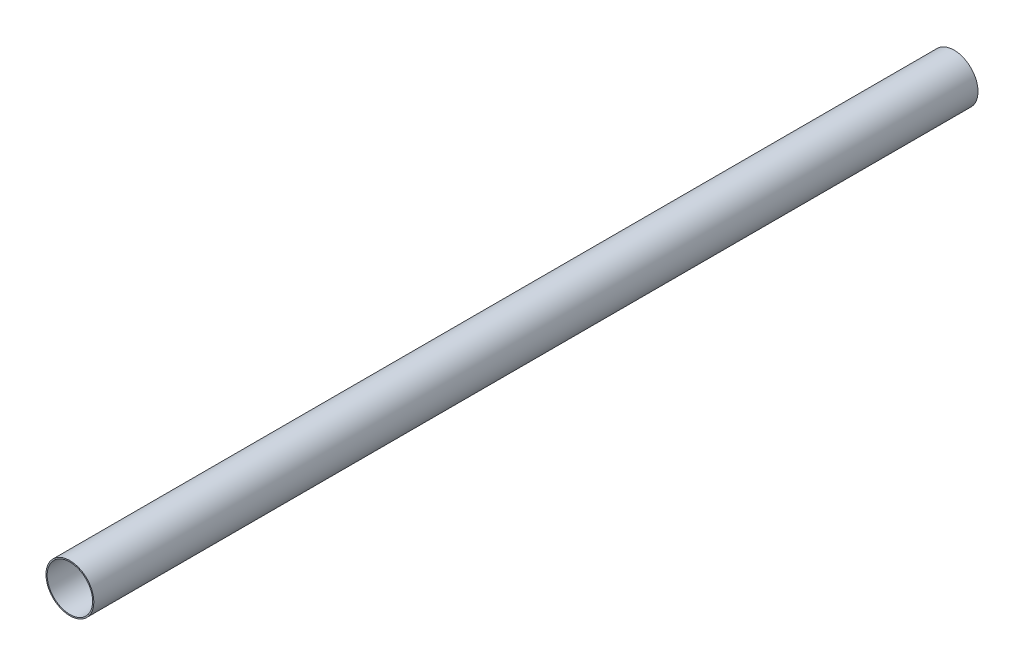
ISO-10303-21;
HEADER;
FILE_DESCRIPTION(('STEP AP214'),'2;1');
FILE_NAME('part.step','',(''),(''),'','','');
FILE_SCHEMA(('AUTOMOTIVE_DESIGN { 1 0 10303 214 1 1 1 1 }'));
ENDSEC;
DATA;
#1=APPLICATION_CONTEXT('core data for automotive mechanical design processes');
#2=APPLICATION_PROTOCOL_DEFINITION('international standard','automotive_design',2000,#1);
#3=PRODUCT_CONTEXT('',#1,'mechanical');
#4=PRODUCT('Part','Part','',(#3));
#5=PRODUCT_RELATED_PRODUCT_CATEGORY('part','',(#4));
#6=PRODUCT_DEFINITION_FORMATION('','',#4);
#7=PRODUCT_DEFINITION_CONTEXT('part definition',#1,'design');
#8=PRODUCT_DEFINITION('design','',#6,#7);
#9=PRODUCT_DEFINITION_SHAPE('','',#8);
#10=(LENGTH_UNIT() NAMED_UNIT(*) SI_UNIT(.MILLI.,.METRE.));
#11=(NAMED_UNIT(*) PLANE_ANGLE_UNIT() SI_UNIT($,.RADIAN.));
#12=(NAMED_UNIT(*) SI_UNIT($,.STERADIAN.) SOLID_ANGLE_UNIT());
#13=UNCERTAINTY_MEASURE_WITH_UNIT(LENGTH_MEASURE(1.E-05),#10,'distance_accuracy_value','');
#14=(GEOMETRIC_REPRESENTATION_CONTEXT(3) GLOBAL_UNCERTAINTY_ASSIGNED_CONTEXT((#13)) GLOBAL_UNIT_ASSIGNED_CONTEXT((#10,
#11,#12)) REPRESENTATION_CONTEXT('',''));
#15=CARTESIAN_POINT('',(0.,0.,0.));
#16=DIRECTION('',(0.,0.,1.));
#17=DIRECTION('',(1.,0.,0.));
#18=AXIS2_PLACEMENT_3D('',#15,#16,#17);
#19=CARTESIAN_POINT('',(0.,0.,563.88));
#20=DIRECTION('',(0.,0.,1.));
#21=DIRECTION('',(1.,0.,0.));
#22=AXIS2_PLACEMENT_3D('',#19,#20,#21);
#23=PLANE('',#22);
#24=CARTESIAN_POINT('',(0.,0.,563.88));
#25=DIRECTION('',(0.,0.,1.));
#26=DIRECTION('',(1.,0.,0.));
#27=AXIS2_PLACEMENT_3D('',#24,#25,#26);
#28=CIRCLE('',#27,15.265);
#29=CARTESIAN_POINT('',(15.265,0.,563.88));
#30=VERTEX_POINT('',#29);
#31=EDGE_CURVE('E10',#30,#30,#28,.T.);
#32=ORIENTED_EDGE('',*,*,#31,.T.);
#33=EDGE_LOOP('',(#32));
#34=FACE_BOUND('',#33,.T.);
#35=CARTESIAN_POINT('',(0.,0.,563.88));
#36=DIRECTION('',(0.,0.,1.));
#37=DIRECTION('',(1.,0.,0.));
#38=AXIS2_PLACEMENT_3D('',#35,#36,#37);
#39=CIRCLE('',#38,14.505);
#40=CARTESIAN_POINT('',(14.505,0.,563.88));
#41=VERTEX_POINT('',#40);
#42=EDGE_CURVE('E48',#41,#41,#39,.T.);
#43=ORIENTED_EDGE('',*,*,#42,.F.);
#44=EDGE_LOOP('',(#43));
#45=FACE_BOUND('',#44,.T.);
#46=ADVANCED_FACE('F37',(#34,#45),#23,.T.);
#47=CARTESIAN_POINT('',(0.,0.,0.));
#48=DIRECTION('',(0.,0.,1.));
#49=DIRECTION('',(1.,0.,0.));
#50=AXIS2_PLACEMENT_3D('',#47,#48,#49);
#51=PLANE('',#50);
#52=CARTESIAN_POINT('',(0.,0.,0.));
#53=DIRECTION('',(0.,0.,1.));
#54=DIRECTION('',(1.,0.,0.));
#55=AXIS2_PLACEMENT_3D('',#52,#53,#54);
#56=CIRCLE('',#55,15.265);
#57=CARTESIAN_POINT('',(15.265,0.,0.));
#58=VERTEX_POINT('',#57);
#59=EDGE_CURVE('E41',#58,#58,#56,.T.);
#60=ORIENTED_EDGE('',*,*,#59,.F.);
#61=EDGE_LOOP('',(#60));
#62=FACE_BOUND('',#61,.T.);
#63=CARTESIAN_POINT('',(0.,0.,0.));
#64=DIRECTION('',(0.,0.,1.));
#65=DIRECTION('',(1.,0.,0.));
#66=AXIS2_PLACEMENT_3D('',#63,#64,#65);
#67=CIRCLE('',#66,14.505);
#68=CARTESIAN_POINT('',(14.505,0.,0.));
#69=VERTEX_POINT('',#68);
#70=EDGE_CURVE('E50',#69,#69,#67,.T.);
#71=ORIENTED_EDGE('',*,*,#70,.T.);
#72=EDGE_LOOP('',(#71));
#73=FACE_BOUND('',#72,.T.);
#74=ADVANCED_FACE('F60',(#62,#73),#51,.F.);
#75=CARTESIAN_POINT('',(0.,0.,563.88));
#76=DIRECTION('',(0.,0.,-1.));
#77=DIRECTION('',(-1.,0.,0.));
#78=AXIS2_PLACEMENT_3D('',#75,#76,#77);
#79=CYLINDRICAL_SURFACE('',#78,15.265);
#80=ORIENTED_EDGE('',*,*,#31,.F.);
#81=EDGE_LOOP('',(#80));
#82=FACE_BOUND('',#81,.T.);
#83=ORIENTED_EDGE('',*,*,#59,.T.);
#84=EDGE_LOOP('',(#83));
#85=FACE_BOUND('',#84,.T.);
#86=ADVANCED_FACE('F39',(#82,#85),#79,.T.);
#87=CARTESIAN_POINT('',(0.,0.,563.88));
#88=DIRECTION('',(0.,0.,-1.));
#89=DIRECTION('',(-1.,0.,0.));
#90=AXIS2_PLACEMENT_3D('',#87,#88,#89);
#91=CYLINDRICAL_SURFACE('',#90,14.505);
#92=ORIENTED_EDGE('',*,*,#42,.T.);
#93=EDGE_LOOP('',(#92));
#94=FACE_BOUND('',#93,.T.);
#95=ORIENTED_EDGE('',*,*,#70,.F.);
#96=EDGE_LOOP('',(#95));
#97=FACE_BOUND('',#96,.T.);
#98=ADVANCED_FACE('F56',(#94,#97),#91,.F.);
#99=CLOSED_SHELL('',(#46,#74,#86,#98));
#100=MANIFOLD_SOLID_BREP('B2',#99);
#101=ADVANCED_BREP_SHAPE_REPRESENTATION('',(#18,#100),#14);
#102=SHAPE_DEFINITION_REPRESENTATION(#9,#101);
ENDSEC;
END-ISO-10303-21;
